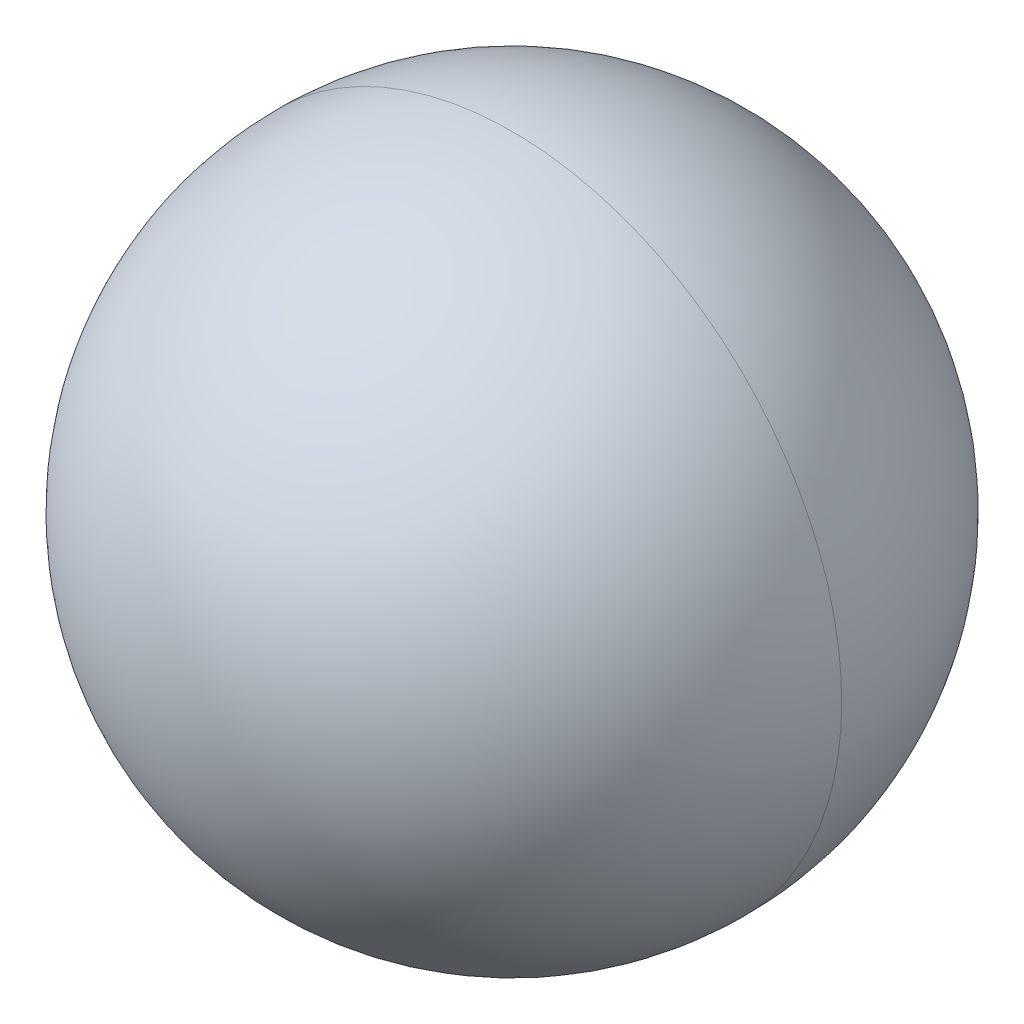
ISO-10303-21;
HEADER;
FILE_DESCRIPTION(('STEP AP214'),'2;1');
FILE_NAME('part.step','',(''),(''),'','','');
FILE_SCHEMA(('AUTOMOTIVE_DESIGN { 1 0 10303 214 1 1 1 1 }'));
ENDSEC;
DATA;
#1=APPLICATION_CONTEXT('core data for automotive mechanical design processes');
#2=APPLICATION_PROTOCOL_DEFINITION('international standard','automotive_design',2000,#1);
#3=PRODUCT_CONTEXT('',#1,'mechanical');
#4=PRODUCT('Part','Part','',(#3));
#5=PRODUCT_RELATED_PRODUCT_CATEGORY('part','',(#4));
#6=PRODUCT_DEFINITION_FORMATION('','',#4);
#7=PRODUCT_DEFINITION_CONTEXT('part definition',#1,'design');
#8=PRODUCT_DEFINITION('design','',#6,#7);
#9=PRODUCT_DEFINITION_SHAPE('','',#8);
#10=(LENGTH_UNIT() NAMED_UNIT(*) SI_UNIT(.MILLI.,.METRE.));
#11=(NAMED_UNIT(*) PLANE_ANGLE_UNIT() SI_UNIT($,.RADIAN.));
#12=(NAMED_UNIT(*) SI_UNIT($,.STERADIAN.) SOLID_ANGLE_UNIT());
#13=UNCERTAINTY_MEASURE_WITH_UNIT(LENGTH_MEASURE(1.E-05),#10,'distance_accuracy_value','');
#14=(GEOMETRIC_REPRESENTATION_CONTEXT(3) GLOBAL_UNCERTAINTY_ASSIGNED_CONTEXT((#13)) GLOBAL_UNIT_ASSIGNED_CONTEXT((#10,
#11,#12)) REPRESENTATION_CONTEXT('',''));
#15=CARTESIAN_POINT('',(0.,0.,0.));
#16=DIRECTION('',(0.,0.,1.));
#17=DIRECTION('',(1.,0.,0.));
#18=AXIS2_PLACEMENT_3D('',#15,#16,#17);
#19=CARTESIAN_POINT('',(6.,15.75,0.));
#20=DIRECTION('',(1.,0.,0.));
#21=DIRECTION('',(0.,0.,-1.));
#22=AXIS2_PLACEMENT_3D('',#19,#20,#21);
#23=SPHERICAL_SURFACE('',#22,3.175);
#24=CARTESIAN_POINT('',(6.,15.75,0.));
#25=DIRECTION('',(0.,0.,1.));
#26=DIRECTION('',(1.,0.,0.));
#27=AXIS2_PLACEMENT_3D('',#24,#25,#26);
#28=CIRCLE('',#27,3.175);
#29=CARTESIAN_POINT('',(9.175,15.75,0.));
#30=VERTEX_POINT('',#29);
#31=CARTESIAN_POINT('',(2.825,15.75,0.));
#32=VERTEX_POINT('',#31);
#33=EDGE_CURVE('E11',#30,#32,#28,.T.);
#34=ORIENTED_EDGE('',*,*,#33,.T.);
#35=CARTESIAN_POINT('',(6.,15.75,0.));
#36=DIRECTION('',(0.,0.,-1.));
#37=DIRECTION('',(1.,0.,0.));
#38=AXIS2_PLACEMENT_3D('',#35,#36,#37);
#39=CIRCLE('',#38,3.175);
#40=EDGE_CURVE('E25',#30,#32,#39,.T.);
#41=ORIENTED_EDGE('',*,*,#40,.F.);
#42=EDGE_LOOP('',(#34,#41));
#43=FACE_BOUND('',#42,.T.);
#44=ADVANCED_FACE('F17',(#43),#23,.T.);
#45=CARTESIAN_POINT('',(6.,15.75,0.));
#46=DIRECTION('',(1.,0.,0.));
#47=DIRECTION('',(0.,0.,1.));
#48=AXIS2_PLACEMENT_3D('',#45,#46,#47);
#49=SPHERICAL_SURFACE('',#48,3.175);
#50=ORIENTED_EDGE('',*,*,#33,.F.);
#51=ORIENTED_EDGE('',*,*,#40,.T.);
#52=EDGE_LOOP('',(#50,#51));
#53=FACE_BOUND('',#52,.T.);
#54=ADVANCED_FACE('F33',(#53),#49,.T.);
#55=CLOSED_SHELL('',(#44,#54));
#56=MANIFOLD_SOLID_BREP('B1',#55);
#57=ADVANCED_BREP_SHAPE_REPRESENTATION('',(#18,#56),#14);
#58=SHAPE_DEFINITION_REPRESENTATION(#9,#57);
ENDSEC;
END-ISO-10303-21;
